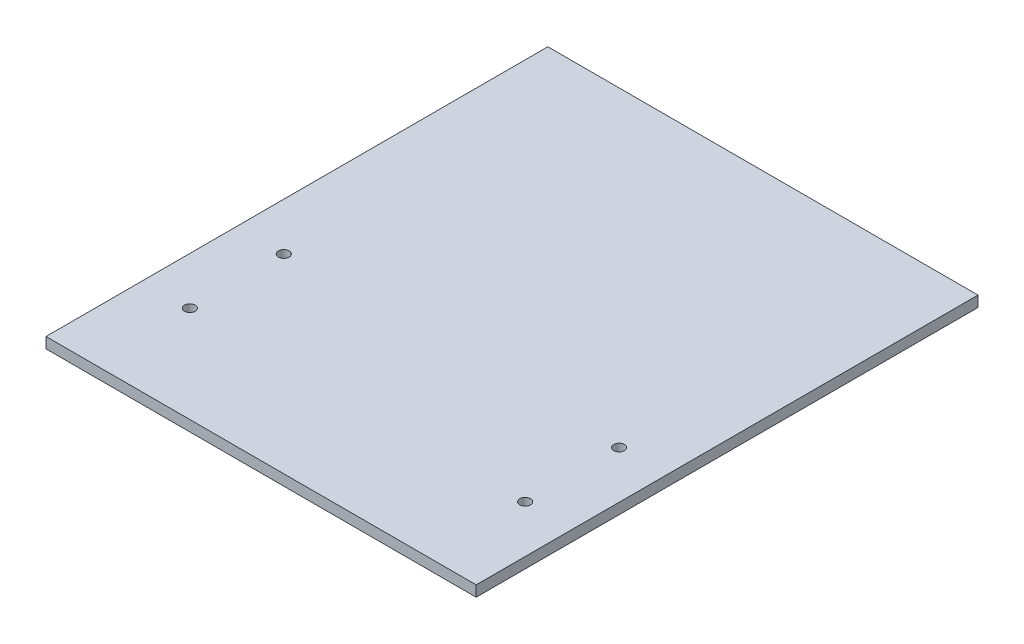
ISO-10303-21;
HEADER;
FILE_DESCRIPTION(('STEP AP214'),'2;1');
FILE_NAME('part.step','',(''),(''),'','','');
FILE_SCHEMA(('AUTOMOTIVE_DESIGN { 1 0 10303 214 1 1 1 1 }'));
ENDSEC;
DATA;
#1=APPLICATION_CONTEXT('core data for automotive mechanical design processes');
#2=APPLICATION_PROTOCOL_DEFINITION('international standard','automotive_design',2000,#1);
#3=PRODUCT_CONTEXT('',#1,'mechanical');
#4=PRODUCT('Part','Part','',(#3));
#5=PRODUCT_RELATED_PRODUCT_CATEGORY('part','',(#4));
#6=PRODUCT_DEFINITION_FORMATION('','',#4);
#7=PRODUCT_DEFINITION_CONTEXT('part definition',#1,'design');
#8=PRODUCT_DEFINITION('design','',#6,#7);
#9=PRODUCT_DEFINITION_SHAPE('','',#8);
#10=(LENGTH_UNIT() NAMED_UNIT(*) SI_UNIT(.MILLI.,.METRE.));
#11=(NAMED_UNIT(*) PLANE_ANGLE_UNIT() SI_UNIT($,.RADIAN.));
#12=(NAMED_UNIT(*) SI_UNIT($,.STERADIAN.) SOLID_ANGLE_UNIT());
#13=UNCERTAINTY_MEASURE_WITH_UNIT(LENGTH_MEASURE(1.E-05),#10,'distance_accuracy_value','');
#14=(GEOMETRIC_REPRESENTATION_CONTEXT(3) GLOBAL_UNCERTAINTY_ASSIGNED_CONTEXT((#13)) GLOBAL_UNIT_ASSIGNED_CONTEXT((#10,
#11,#12)) REPRESENTATION_CONTEXT('',''));
#15=CARTESIAN_POINT('',(0.,0.,0.));
#16=DIRECTION('',(0.,0.,1.));
#17=DIRECTION('',(1.,0.,0.));
#18=AXIS2_PLACEMENT_3D('',#15,#16,#17);
#19=CARTESIAN_POINT('',(60.,3.,70.));
#20=DIRECTION('',(-1.,0.,0.));
#21=DIRECTION('',(0.,0.,1.));
#22=AXIS2_PLACEMENT_3D('',#19,#20,#21);
#23=PLANE('',#22);
#24=DIRECTION('',(0.,0.,-1.));
#25=VECTOR('',#24,1.);
#26=CARTESIAN_POINT('',(60.,0.,70.));
#27=LINE('',#26,#25);
#28=CARTESIAN_POINT('',(60.,0.,70.));
#29=VERTEX_POINT('',#28);
#30=CARTESIAN_POINT('',(60.,0.,-70.));
#31=VERTEX_POINT('',#30);
#32=EDGE_CURVE('E96',#29,#31,#27,.T.);
#33=ORIENTED_EDGE('',*,*,#32,.T.);
#34=DIRECTION('',(0.,-1.,0.));
#35=VECTOR('',#34,1.);
#36=CARTESIAN_POINT('',(60.,3.,-70.));
#37=LINE('',#36,#35);
#38=CARTESIAN_POINT('',(60.,3.,-70.));
#39=VERTEX_POINT('',#38);
#40=EDGE_CURVE('E11',#39,#31,#37,.T.);
#41=ORIENTED_EDGE('',*,*,#40,.F.);
#42=DIRECTION('',(0.,0.,-1.));
#43=VECTOR('',#42,1.);
#44=CARTESIAN_POINT('',(60.,3.,70.));
#45=LINE('',#44,#43);
#46=CARTESIAN_POINT('',(60.,3.,70.));
#47=VERTEX_POINT('',#46);
#48=EDGE_CURVE('E84',#47,#39,#45,.T.);
#49=ORIENTED_EDGE('',*,*,#48,.F.);
#50=DIRECTION('',(0.,-1.,0.));
#51=VECTOR('',#50,1.);
#52=CARTESIAN_POINT('',(60.,3.,70.));
#53=LINE('',#52,#51);
#54=EDGE_CURVE('E92',#47,#29,#53,.T.);
#55=ORIENTED_EDGE('',*,*,#54,.T.);
#56=EDGE_LOOP('',(#33,#41,#49,#55));
#57=FACE_BOUND('',#56,.T.);
#58=ADVANCED_FACE('F33',(#57),#23,.F.);
#59=CARTESIAN_POINT('',(-60.,3.,-70.));
#60=DIRECTION('',(0.,0.,1.));
#61=DIRECTION('',(1.,0.,0.));
#62=AXIS2_PLACEMENT_3D('',#59,#60,#61);
#63=PLANE('',#62);
#64=DIRECTION('',(-1.,0.,0.));
#65=VECTOR('',#64,1.);
#66=CARTESIAN_POINT('',(-60.,0.,-70.));
#67=LINE('',#66,#65);
#68=CARTESIAN_POINT('',(-60.,0.,-70.));
#69=VERTEX_POINT('',#68);
#70=EDGE_CURVE('E88',#31,#69,#67,.T.);
#71=ORIENTED_EDGE('',*,*,#70,.T.);
#72=DIRECTION('',(0.,-1.,0.));
#73=VECTOR('',#72,1.);
#74=CARTESIAN_POINT('',(-60.,3.,-70.));
#75=LINE('',#74,#73);
#76=CARTESIAN_POINT('',(-60.,3.,-70.));
#77=VERTEX_POINT('',#76);
#78=EDGE_CURVE('E41',#77,#69,#75,.T.);
#79=ORIENTED_EDGE('',*,*,#78,.F.);
#80=DIRECTION('',(-1.,0.,0.));
#81=VECTOR('',#80,1.);
#82=CARTESIAN_POINT('',(-60.,3.,-70.));
#83=LINE('',#82,#81);
#84=EDGE_CURVE('E79',#39,#77,#83,.T.);
#85=ORIENTED_EDGE('',*,*,#84,.F.);
#86=ORIENTED_EDGE('',*,*,#40,.T.);
#87=EDGE_LOOP('',(#71,#79,#85,#86));
#88=FACE_BOUND('',#87,.T.);
#89=ADVANCED_FACE('F87',(#88),#63,.F.);
#90=CARTESIAN_POINT('',(-60.,3.,70.));
#91=DIRECTION('',(1.,0.,0.));
#92=DIRECTION('',(0.,0.,-1.));
#93=AXIS2_PLACEMENT_3D('',#90,#91,#92);
#94=PLANE('',#93);
#95=DIRECTION('',(0.,0.,1.));
#96=VECTOR('',#95,1.);
#97=CARTESIAN_POINT('',(-60.,0.,70.));
#98=LINE('',#97,#96);
#99=CARTESIAN_POINT('',(-60.,0.,70.));
#100=VERTEX_POINT('',#99);
#101=EDGE_CURVE('E66',#69,#100,#98,.T.);
#102=ORIENTED_EDGE('',*,*,#101,.T.);
#103=DIRECTION('',(0.,-1.,0.));
#104=VECTOR('',#103,1.);
#105=CARTESIAN_POINT('',(-60.,3.,70.));
#106=LINE('',#105,#104);
#107=CARTESIAN_POINT('',(-60.,3.,70.));
#108=VERTEX_POINT('',#107);
#109=EDGE_CURVE('E89',#108,#100,#106,.T.);
#110=ORIENTED_EDGE('',*,*,#109,.F.);
#111=DIRECTION('',(0.,0.,1.));
#112=VECTOR('',#111,1.);
#113=CARTESIAN_POINT('',(-60.,3.,70.));
#114=LINE('',#113,#112);
#115=EDGE_CURVE('E82',#77,#108,#114,.T.);
#116=ORIENTED_EDGE('',*,*,#115,.F.);
#117=ORIENTED_EDGE('',*,*,#78,.T.);
#118=EDGE_LOOP('',(#102,#110,#116,#117));
#119=FACE_BOUND('',#118,.T.);
#120=ADVANCED_FACE('F90',(#119),#94,.F.);
#121=CARTESIAN_POINT('',(-60.,3.,70.));
#122=DIRECTION('',(0.,0.,-1.));
#123=DIRECTION('',(-1.,0.,0.));
#124=AXIS2_PLACEMENT_3D('',#121,#122,#123);
#125=PLANE('',#124);
#126=DIRECTION('',(1.,0.,0.));
#127=VECTOR('',#126,1.);
#128=CARTESIAN_POINT('',(-60.,0.,70.));
#129=LINE('',#128,#127);
#130=EDGE_CURVE('E72',#100,#29,#129,.T.);
#131=ORIENTED_EDGE('',*,*,#130,.T.);
#132=ORIENTED_EDGE('',*,*,#54,.F.);
#133=DIRECTION('',(1.,0.,0.));
#134=VECTOR('',#133,1.);
#135=CARTESIAN_POINT('',(-60.,3.,70.));
#136=LINE('',#135,#134);
#137=EDGE_CURVE('E49',#108,#47,#136,.T.);
#138=ORIENTED_EDGE('',*,*,#137,.F.);
#139=ORIENTED_EDGE('',*,*,#109,.T.);
#140=EDGE_LOOP('',(#131,#132,#138,#139));
#141=FACE_BOUND('',#140,.T.);
#142=ADVANCED_FACE('F104',(#141),#125,.F.);
#143=CARTESIAN_POINT('',(0.,3.,0.));
#144=DIRECTION('',(0.,-1.,0.));
#145=DIRECTION('',(0.,0.,-1.));
#146=AXIS2_PLACEMENT_3D('',#143,#144,#145);
#147=PLANE('',#146);
#148=CARTESIAN_POINT('',(46.7702467485728,3.,16.9));
#149=DIRECTION('',(0.,1.,0.));
#150=DIRECTION('',(0.,0.,-1.));
#151=AXIS2_PLACEMENT_3D('',#148,#149,#150);
#152=CIRCLE('',#151,1.5);
#153=CARTESIAN_POINT('',(46.7702467485728,3.,15.4));
#154=VERTEX_POINT('',#153);
#155=EDGE_CURVE('E128',#154,#154,#152,.T.);
#156=ORIENTED_EDGE('',*,*,#155,.F.);
#157=EDGE_LOOP('',(#156));
#158=FACE_BOUND('',#157,.T.);
#159=CARTESIAN_POINT('',(46.7702467485728,3.,43.1));
#160=DIRECTION('',(0.,1.,0.));
#161=DIRECTION('',(0.,0.,-1.));
#162=AXIS2_PLACEMENT_3D('',#159,#160,#161);
#163=CIRCLE('',#162,1.5);
#164=CARTESIAN_POINT('',(46.7702467485728,3.,41.6));
#165=VERTEX_POINT('',#164);
#166=EDGE_CURVE('E122',#165,#165,#163,.T.);
#167=ORIENTED_EDGE('',*,*,#166,.F.);
#168=EDGE_LOOP('',(#167));
#169=FACE_BOUND('',#168,.T.);
#170=CARTESIAN_POINT('',(-46.7702467485728,3.,43.1));
#171=DIRECTION('',(0.,1.,0.));
#172=DIRECTION('',(0.,0.,1.));
#173=AXIS2_PLACEMENT_3D('',#170,#171,#172);
#174=CIRCLE('',#173,1.5);
#175=CARTESIAN_POINT('',(-46.7702467485728,3.,44.6));
#176=VERTEX_POINT('',#175);
#177=EDGE_CURVE('E116',#176,#176,#174,.T.);
#178=ORIENTED_EDGE('',*,*,#177,.F.);
#179=EDGE_LOOP('',(#178));
#180=FACE_BOUND('',#179,.T.);
#181=CARTESIAN_POINT('',(-46.7702467485728,3.,16.9));
#182=DIRECTION('',(0.,1.,0.));
#183=DIRECTION('',(0.,0.,1.));
#184=AXIS2_PLACEMENT_3D('',#181,#182,#183);
#185=CIRCLE('',#184,1.5);
#186=CARTESIAN_POINT('',(-46.7702467485728,3.,18.4));
#187=VERTEX_POINT('',#186);
#188=EDGE_CURVE('E110',#187,#187,#185,.T.);
#189=ORIENTED_EDGE('',*,*,#188,.F.);
#190=EDGE_LOOP('',(#189));
#191=FACE_BOUND('',#190,.T.);
#192=ORIENTED_EDGE('',*,*,#48,.T.);
#193=ORIENTED_EDGE('',*,*,#84,.T.);
#194=ORIENTED_EDGE('',*,*,#115,.T.);
#195=ORIENTED_EDGE('',*,*,#137,.T.);
#196=EDGE_LOOP('',(#192,#193,#194,#195));
#197=FACE_BOUND('',#196,.T.);
#198=ADVANCED_FACE('F80',(#158,#169,#180,#191,#197),#147,.F.);
#199=CARTESIAN_POINT('',(0.,0.,0.));
#200=DIRECTION('',(0.,-1.,0.));
#201=DIRECTION('',(0.,0.,-1.));
#202=AXIS2_PLACEMENT_3D('',#199,#200,#201);
#203=PLANE('',#202);
#204=CARTESIAN_POINT('',(46.7702467485728,0.,16.9));
#205=DIRECTION('',(0.,1.,0.));
#206=DIRECTION('',(0.,0.,-1.));
#207=AXIS2_PLACEMENT_3D('',#204,#205,#206);
#208=CIRCLE('',#207,1.5);
#209=CARTESIAN_POINT('',(46.7702467485728,0.,15.4));
#210=VERTEX_POINT('',#209);
#211=EDGE_CURVE('E125',#210,#210,#208,.T.);
#212=ORIENTED_EDGE('',*,*,#211,.T.);
#213=EDGE_LOOP('',(#212));
#214=FACE_BOUND('',#213,.T.);
#215=CARTESIAN_POINT('',(46.7702467485728,0.,43.1));
#216=DIRECTION('',(0.,1.,0.));
#217=DIRECTION('',(0.,0.,-1.));
#218=AXIS2_PLACEMENT_3D('',#215,#216,#217);
#219=CIRCLE('',#218,1.5);
#220=CARTESIAN_POINT('',(46.7702467485728,0.,41.6));
#221=VERTEX_POINT('',#220);
#222=EDGE_CURVE('E119',#221,#221,#219,.T.);
#223=ORIENTED_EDGE('',*,*,#222,.T.);
#224=EDGE_LOOP('',(#223));
#225=FACE_BOUND('',#224,.T.);
#226=CARTESIAN_POINT('',(-46.7702467485728,0.,43.1));
#227=DIRECTION('',(0.,1.,0.));
#228=DIRECTION('',(0.,0.,1.));
#229=AXIS2_PLACEMENT_3D('',#226,#227,#228);
#230=CIRCLE('',#229,1.5);
#231=CARTESIAN_POINT('',(-46.7702467485728,0.,44.6));
#232=VERTEX_POINT('',#231);
#233=EDGE_CURVE('E113',#232,#232,#230,.T.);
#234=ORIENTED_EDGE('',*,*,#233,.T.);
#235=EDGE_LOOP('',(#234));
#236=FACE_BOUND('',#235,.T.);
#237=CARTESIAN_POINT('',(-46.7702467485728,0.,16.9));
#238=DIRECTION('',(0.,1.,0.));
#239=DIRECTION('',(0.,0.,1.));
#240=AXIS2_PLACEMENT_3D('',#237,#238,#239);
#241=CIRCLE('',#240,1.5);
#242=CARTESIAN_POINT('',(-46.7702467485728,0.,18.4));
#243=VERTEX_POINT('',#242);
#244=EDGE_CURVE('E99',#243,#243,#241,.T.);
#245=ORIENTED_EDGE('',*,*,#244,.T.);
#246=EDGE_LOOP('',(#245));
#247=FACE_BOUND('',#246,.T.);
#248=ORIENTED_EDGE('',*,*,#32,.F.);
#249=ORIENTED_EDGE('',*,*,#130,.F.);
#250=ORIENTED_EDGE('',*,*,#101,.F.);
#251=ORIENTED_EDGE('',*,*,#70,.F.);
#252=EDGE_LOOP('',(#248,#249,#250,#251));
#253=FACE_BOUND('',#252,.T.);
#254=ADVANCED_FACE('F107',(#214,#225,#236,#247,#253),#203,.T.);
#255=CARTESIAN_POINT('',(-46.7702467485728,0.,16.9));
#256=DIRECTION('',(0.,1.,0.));
#257=DIRECTION('',(0.,0.,1.));
#258=AXIS2_PLACEMENT_3D('',#255,#256,#257);
#259=CYLINDRICAL_SURFACE('',#258,1.5);
#260=ORIENTED_EDGE('',*,*,#244,.F.);
#261=EDGE_LOOP('',(#260));
#262=FACE_BOUND('',#261,.T.);
#263=ORIENTED_EDGE('',*,*,#188,.T.);
#264=EDGE_LOOP('',(#263));
#265=FACE_BOUND('',#264,.T.);
#266=ADVANCED_FACE('F152',(#262,#265),#259,.F.);
#267=CARTESIAN_POINT('',(-46.7702467485728,0.,43.1));
#268=DIRECTION('',(0.,1.,0.));
#269=DIRECTION('',(0.,0.,1.));
#270=AXIS2_PLACEMENT_3D('',#267,#268,#269);
#271=CYLINDRICAL_SURFACE('',#270,1.5);
#272=ORIENTED_EDGE('',*,*,#233,.F.);
#273=EDGE_LOOP('',(#272));
#274=FACE_BOUND('',#273,.T.);
#275=ORIENTED_EDGE('',*,*,#177,.T.);
#276=EDGE_LOOP('',(#275));
#277=FACE_BOUND('',#276,.T.);
#278=ADVANCED_FACE('F154',(#274,#277),#271,.F.);
#279=CARTESIAN_POINT('',(46.7702467485728,0.,43.1));
#280=DIRECTION('',(0.,1.,0.));
#281=DIRECTION('',(0.,0.,1.));
#282=AXIS2_PLACEMENT_3D('',#279,#280,#281);
#283=CYLINDRICAL_SURFACE('',#282,1.5);
#284=ORIENTED_EDGE('',*,*,#222,.F.);
#285=EDGE_LOOP('',(#284));
#286=FACE_BOUND('',#285,.T.);
#287=ORIENTED_EDGE('',*,*,#166,.T.);
#288=EDGE_LOOP('',(#287));
#289=FACE_BOUND('',#288,.T.);
#290=ADVANCED_FACE('F139',(#286,#289),#283,.F.);
#291=CARTESIAN_POINT('',(46.7702467485728,0.,16.9));
#292=DIRECTION('',(0.,1.,0.));
#293=DIRECTION('',(0.,0.,1.));
#294=AXIS2_PLACEMENT_3D('',#291,#292,#293);
#295=CYLINDRICAL_SURFACE('',#294,1.5);
#296=ORIENTED_EDGE('',*,*,#211,.F.);
#297=EDGE_LOOP('',(#296));
#298=FACE_BOUND('',#297,.T.);
#299=ORIENTED_EDGE('',*,*,#155,.T.);
#300=EDGE_LOOP('',(#299));
#301=FACE_BOUND('',#300,.T.);
#302=ADVANCED_FACE('F136',(#298,#301),#295,.F.);
#303=CLOSED_SHELL('',(#58,#89,#120,#142,#198,#254,#266,#278,#290,#302));
#304=MANIFOLD_SOLID_BREP('B2',#303);
#305=ADVANCED_BREP_SHAPE_REPRESENTATION('',(#18,#304),#14);
#306=SHAPE_DEFINITION_REPRESENTATION(#9,#305);
ENDSEC;
END-ISO-10303-21;
